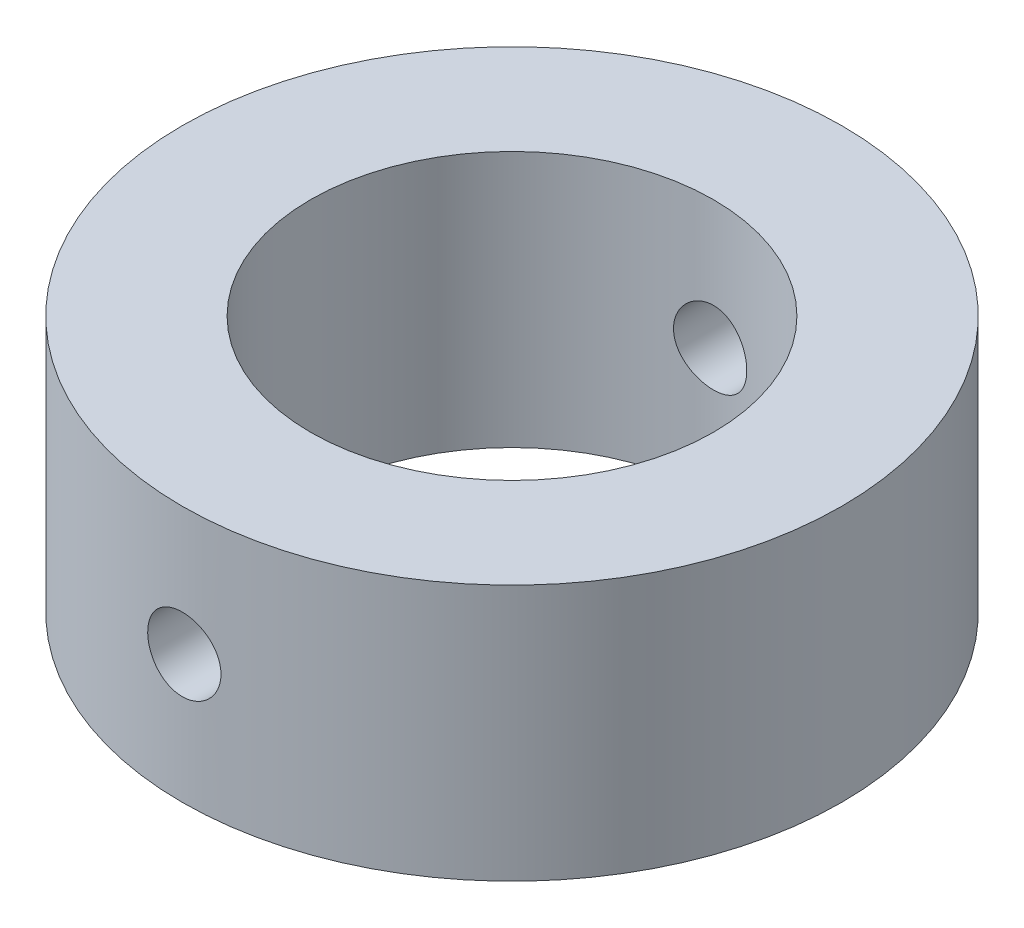
ISO-10303-21;
HEADER;
FILE_DESCRIPTION(('STEP AP214'),'2;1');
FILE_NAME('part.step','',(''),(''),'','','');
FILE_SCHEMA(('AUTOMOTIVE_DESIGN { 1 0 10303 214 1 1 1 1 }'));
ENDSEC;
DATA;
#1=APPLICATION_CONTEXT('core data for automotive mechanical design processes');
#2=APPLICATION_PROTOCOL_DEFINITION('international standard','automotive_design',2000,#1);
#3=PRODUCT_CONTEXT('',#1,'mechanical');
#4=PRODUCT('Part','Part','',(#3));
#5=PRODUCT_RELATED_PRODUCT_CATEGORY('part','',(#4));
#6=PRODUCT_DEFINITION_FORMATION('','',#4);
#7=PRODUCT_DEFINITION_CONTEXT('part definition',#1,'design');
#8=PRODUCT_DEFINITION('design','',#6,#7);
#9=PRODUCT_DEFINITION_SHAPE('','',#8);
#10=(LENGTH_UNIT() NAMED_UNIT(*) SI_UNIT(.MILLI.,.METRE.));
#11=(NAMED_UNIT(*) PLANE_ANGLE_UNIT() SI_UNIT($,.RADIAN.));
#12=(NAMED_UNIT(*) SI_UNIT($,.STERADIAN.) SOLID_ANGLE_UNIT());
#13=UNCERTAINTY_MEASURE_WITH_UNIT(LENGTH_MEASURE(1.E-05),#10,'distance_accuracy_value','');
#14=(GEOMETRIC_REPRESENTATION_CONTEXT(3) GLOBAL_UNCERTAINTY_ASSIGNED_CONTEXT((#13)) GLOBAL_UNIT_ASSIGNED_CONTEXT((#10,
#11,#12)) REPRESENTATION_CONTEXT('',''));
#15=CARTESIAN_POINT('',(0.,0.,0.));
#16=DIRECTION('',(0.,0.,1.));
#17=DIRECTION('',(1.,0.,0.));
#18=AXIS2_PLACEMENT_3D('',#15,#16,#17);
#19=CARTESIAN_POINT('',(0.,7.,0.));
#20=DIRECTION('',(0.,1.,0.));
#21=DIRECTION('',(0.,0.,1.));
#22=AXIS2_PLACEMENT_3D('',#19,#20,#21);
#23=PLANE('',#22);
#24=CARTESIAN_POINT('',(0.,7.,0.));
#25=DIRECTION('',(0.,1.,0.));
#26=DIRECTION('',(0.,0.,1.));
#27=AXIS2_PLACEMENT_3D('',#24,#25,#26);
#28=CIRCLE('',#27,18.);
#29=CARTESIAN_POINT('',(0.,7.,18.));
#30=VERTEX_POINT('',#29);
#31=EDGE_CURVE('E10',#30,#30,#28,.T.);
#32=ORIENTED_EDGE('',*,*,#31,.T.);
#33=EDGE_LOOP('',(#32));
#34=FACE_BOUND('',#33,.T.);
#35=CARTESIAN_POINT('',(0.,7.,0.));
#36=DIRECTION('',(0.,1.,0.));
#37=DIRECTION('',(0.,0.,1.));
#38=AXIS2_PLACEMENT_3D('',#35,#36,#37);
#39=CIRCLE('',#38,11.);
#40=CARTESIAN_POINT('',(0.,7.,11.));
#41=VERTEX_POINT('',#40);
#42=EDGE_CURVE('E60',#41,#41,#39,.T.);
#43=ORIENTED_EDGE('',*,*,#42,.F.);
#44=EDGE_LOOP('',(#43));
#45=FACE_BOUND('',#44,.T.);
#46=ADVANCED_FACE('F41',(#34,#45),#23,.T.);
#47=CARTESIAN_POINT('',(0.,-7.,0.));
#48=DIRECTION('',(0.,1.,0.));
#49=DIRECTION('',(0.,0.,1.));
#50=AXIS2_PLACEMENT_3D('',#47,#48,#49);
#51=PLANE('',#50);
#52=CARTESIAN_POINT('',(0.,-7.,0.));
#53=DIRECTION('',(0.,1.,0.));
#54=DIRECTION('',(0.,0.,1.));
#55=AXIS2_PLACEMENT_3D('',#52,#53,#54);
#56=CIRCLE('',#55,18.);
#57=CARTESIAN_POINT('',(0.,-7.,18.));
#58=VERTEX_POINT('',#57);
#59=EDGE_CURVE('E55',#58,#58,#56,.T.);
#60=ORIENTED_EDGE('',*,*,#59,.F.);
#61=EDGE_LOOP('',(#60));
#62=FACE_BOUND('',#61,.T.);
#63=CARTESIAN_POINT('',(0.,-7.,0.));
#64=DIRECTION('',(0.,1.,0.));
#65=DIRECTION('',(0.,0.,1.));
#66=AXIS2_PLACEMENT_3D('',#63,#64,#65);
#67=CIRCLE('',#66,11.);
#68=CARTESIAN_POINT('',(0.,-7.,11.));
#69=VERTEX_POINT('',#68);
#70=EDGE_CURVE('E63',#69,#69,#67,.T.);
#71=ORIENTED_EDGE('',*,*,#70,.T.);
#72=EDGE_LOOP('',(#71));
#73=FACE_BOUND('',#72,.T.);
#74=ADVANCED_FACE('F99',(#62,#73),#51,.F.);
#75=CARTESIAN_POINT('',(0.,7.,0.));
#76=DIRECTION('',(0.,-1.,0.));
#77=DIRECTION('',(0.,0.,-1.));
#78=AXIS2_PLACEMENT_3D('',#75,#76,#77);
#79=CYLINDRICAL_SURFACE('',#78,18.);
#80=CARTESIAN_POINT('',(0.,2.,-18.));
#81=CARTESIAN_POINT('',(-0.111970632349519,1.99999518717274,-17.9999985855436));
#82=CARTESIAN_POINT('',(-0.22401360296951,1.99056525489512,-17.9989441411048));
#83=CARTESIAN_POINT('',(-0.444988473846702,1.95309247157582,-17.9948391595619));
#84=CARTESIAN_POINT('',(-0.553916889117786,1.92502956094916,-17.9917864712715));
#85=CARTESIAN_POINT('',(-0.765431079070291,1.85112204481784,-17.9840293073923));
#86=CARTESIAN_POINT('',(-0.868020820737628,1.8052886941403,-17.9793258774716));
#87=CARTESIAN_POINT('',(-1.06403053009986,1.69716438580146,-17.9687919810869));
#88=CARTESIAN_POINT('',(-1.1574522117349,1.63487651233084,-17.9629617258869));
#89=CARTESIAN_POINT('',(-1.33290575747026,1.49531794987183,-17.9507977181856));
#90=CARTESIAN_POINT('',(-1.4148915795421,1.41798953514322,-17.9444620831364));
#91=CARTESIAN_POINT('',(-1.56475003710051,1.2506685239635,-17.9320167832537));
#92=CARTESIAN_POINT('',(-1.63262199299226,1.16067531804146,-17.9259071293129));
#93=CARTESIAN_POINT('',(-1.7524930181623,0.970286071769773,-17.9145866794937));
#94=CARTESIAN_POINT('',(-1.80444975542339,0.869863222950149,-17.9093782965755));
#95=CARTESIAN_POINT('',(-1.89074517800796,0.661650539312929,-17.9004741803531));
#96=CARTESIAN_POINT('',(-1.92508439501976,0.553860926931999,-17.8967784014));
#97=CARTESIAN_POINT('',(-1.97503194492644,0.334448002135696,-17.8913354423153));
#98=CARTESIAN_POINT('',(-1.99071729842217,0.222842424929062,-17.8895802517469));
#99=CARTESIAN_POINT('',(-2.00315006003506,-0.00142986183008502,-17.8881925066123));
#100=CARTESIAN_POINT('',(-1.99989807564483,-0.114096537227774,-17.8885598839559));
#101=CARTESIAN_POINT('',(-1.97461184427901,-0.336759474971588,-17.891368441014));
#102=CARTESIAN_POINT('',(-1.95266200172973,-0.446765456674598,-17.8938003012309));
#103=CARTESIAN_POINT('',(-1.89073461157689,-0.661522625388757,-17.9004492717341));
#104=CARTESIAN_POINT('',(-1.85075676930152,-0.766273726476568,-17.904666411201));
#105=CARTESIAN_POINT('',(-1.75381606079451,-0.967812423163108,-17.9144214425039));
#106=CARTESIAN_POINT('',(-1.6968160688148,-1.06458201601582,-17.9199622158801));
#107=CARTESIAN_POINT('',(-1.56747570663675,-1.24721365073087,-17.9317378723191));
#108=CARTESIAN_POINT('',(-1.49513478176794,-1.33307529802335,-17.9379727804753));
#109=CARTESIAN_POINT('',(-1.33669614893956,-1.49194398430861,-17.9504756897929));
#110=CARTESIAN_POINT('',(-1.25052560566827,-1.56487840522475,-17.9567436860931));
#111=CARTESIAN_POINT('',(-1.06712581996098,-1.69525838167234,-17.9685745710182));
#112=CARTESIAN_POINT('',(-0.969896560277035,-1.75270391304576,-17.9741374585434));
#113=CARTESIAN_POINT('',(-0.767086635535504,-1.85047376476476,-17.9839338102592));
#114=CARTESIAN_POINT('',(-0.661504004801704,-1.89079404097506,-17.9881669603705));
#115=CARTESIAN_POINT('',(-0.445009755639361,-1.95311377504167,-17.9948238450129));
#116=CARTESIAN_POINT('',(-0.334098334257908,-1.97511390978633,-17.997247646395));
#117=CARTESIAN_POINT('',(-0.110723331894269,-2.00007590171753,-18.0000041106556));
#118=CARTESIAN_POINT('',(0.00172892889089294,-2.00313789379621,-18.0003477720089));
#119=CARTESIAN_POINT('',(0.225544988687161,-1.99040020748693,-17.998934812043));
#120=CARTESIAN_POINT('',(0.33690880589132,-1.97460084490708,-17.9971782258895));
#121=CARTESIAN_POINT('',(0.555095059423331,-1.92467205954415,-17.9917690933051));
#122=CARTESIAN_POINT('',(0.661928438561836,-1.89058988188252,-17.9881214344582));
#123=CARTESIAN_POINT('',(0.868362270126896,-1.80511172227189,-17.9793390034163));
#124=CARTESIAN_POINT('',(0.967962524792293,-1.75371526714897,-17.9742041905801));
#125=CARTESIAN_POINT('',(1.15755326511746,-1.63482170892903,-17.9629935700227));
#126=CARTESIAN_POINT('',(1.24750253139102,-1.56725923906018,-17.9569139780361));
#127=CARTESIAN_POINT('',(1.41481983480219,-1.41804470166563,-17.9445071585437));
#128=CARTESIAN_POINT('',(1.49218748015557,-1.33639219554766,-17.938179923334));
#129=CARTESIAN_POINT('',(1.63249622432816,-1.16087671093394,-17.925957484036));
#130=CARTESIAN_POINT('',(1.69537132537921,-1.06696080952172,-17.920064336427));
#131=CARTESIAN_POINT('',(1.80445556005008,-0.869843716507564,-17.9094097287311));
#132=CARTESIAN_POINT('',(1.85066496700075,-0.766642677224086,-17.9046482500845));
#133=CARTESIAN_POINT('',(1.92499712101143,-0.554105541283379,-17.8968094822665));
#134=CARTESIAN_POINT('',(1.95315827481128,-0.44478301425242,-17.8937286188355));
#135=CARTESIAN_POINT('',(1.99071877766797,-0.222924852258367,-17.8895891957456));
#136=CARTESIAN_POINT('',(2.00011880320655,-0.11038933329655,-17.8885305631698));
#137=CARTESIAN_POINT('',(1.99987957341679,0.114044155065053,-17.8885572584665));
#138=CARTESIAN_POINT('',(1.99034399043058,0.225942250680951,-17.8896309120887));
#139=CARTESIAN_POINT('',(1.9527225008048,0.446535738325604,-17.8937762295707));
#140=CARTESIAN_POINT('',(1.92463658036714,0.555231127972063,-17.8968478949167));
#141=CARTESIAN_POINT('',(1.85074191262564,0.766327510509217,-17.9046397451111));
#142=CARTESIAN_POINT('',(1.80493703938195,0.868729873635424,-17.9093595695852));
#143=CARTESIAN_POINT('',(1.69691508787252,1.0644104934481,-17.9199166120206));
#144=CARTESIAN_POINT('',(1.63469797623759,1.15768873158296,-17.9257538322538));
#145=CARTESIAN_POINT('',(1.49522995253707,1.33300424612643,-17.9379262794022));
#146=CARTESIAN_POINT('',(1.41790170900318,1.41497983547593,-17.944263963574));
#147=CARTESIAN_POINT('',(1.25056419248413,1.5648338722108,-17.9567010614173));
#148=CARTESIAN_POINT('',(1.16055190760651,1.63270896185917,-17.962800418056));
#149=CARTESIAN_POINT('',(0.970094486774868,1.75260433035013,-17.9740935209669));
#150=CARTESIAN_POINT('',(0.869618446416091,1.80457574973094,-17.9792844558708));
#151=CARTESIAN_POINT('',(0.66136849516123,1.89083749244483,-17.9881463543356));
#152=CARTESIAN_POINT('',(0.55360283994444,1.92514745073418,-17.9918190049356));
#153=CARTESIAN_POINT('',(0.371040239312598,1.96669916146577,-17.9963232552591));
#154=CARTESIAN_POINT('',(0.297404134861362,1.97916954843922,-17.9976954860037));
#155=CARTESIAN_POINT('',(0.149189389902707,1.99582154886399,-17.9995343271896));
#156=CARTESIAN_POINT('',(0.0746107544775069,2.00000320698978,-18.000000942512));
#157=CARTESIAN_POINT('',(0.,2.,-18.));
#158=B_SPLINE_CURVE_WITH_KNOTS('',3,(#80,#81,#82,#83,#84,#85,#86,#87,#88,#89,#90,#91,#92,#93,
#94,#95,#96,#97,#98,#99,#100,#101,#102,#103,#104,#105,#106,#107,#108,#109,#110,#111,#112,#113,
#114,#115,#116,#117,#118,#119,#120,#121,#122,#123,#124,#125,#126,#127,#128,#129,#130,#131,#132,
#133,#134,#135,#136,#137,#138,#139,#140,#141,#142,#143,#144,#145,#146,#147,#148,#149,#150,#151,
#152,#153,#154,#155,#156,#157),.UNSPECIFIED.,.T.,.F.,(4,2,2,2,2,2,2,2,2,2,2,2,2,2,2,2,2,2,2,2,2,
2,2,2,2,2,2,2,2,2,2,2,2,2,2,2,2,2,4),(0.,0.335639414270807,0.671640752838988,1.00742963320074,
1.34315561881719,1.68019649784365,2.01725360192296,2.35519959306228,2.69313538455338,
3.02967096220247,3.36619574415512,3.70120941343134,4.03622855878184,4.37198379333011,
4.70775116959619,5.0453487253329,5.3829468076176,5.72062456954608,6.05828985448105,
6.39416820670407,6.73004093517319,7.06504987759405,7.40006797606269,7.73646430887643,
8.07287111486782,8.41078088557856,8.74868511404414,9.08586787252136,9.42303847276942,
9.75836815539861,10.0936980874527,10.4289547445926,10.7642120833782,11.1012322946639,
11.4383326684529,11.7764585228658,12.1142076528796,12.3378595549845,12.5615102516508),.UNSPECIFIED.);
#159=CARTESIAN_POINT('',(0.,2.,-18.));
#160=VERTEX_POINT('',#159);
#161=EDGE_CURVE('E88',#160,#160,#158,.T.);
#162=ORIENTED_EDGE('',*,*,#161,.T.);
#163=EDGE_LOOP('',(#162));
#164=FACE_BOUND('',#163,.T.);
#165=CARTESIAN_POINT('',(2.,0.,17.8885438199983));
#166=CARTESIAN_POINT('',(1.99999518503575,-0.111968226954188,17.8885452673513));
#167=CARTESIAN_POINT('',(1.99056564422495,-0.22400879952899,17.8896064083062));
#168=CARTESIAN_POINT('',(1.9530945571327,-0.444978688113826,17.8937353069379));
#169=CARTESIAN_POINT('',(1.92503294287933,-0.553904517249662,17.8968052281518));
#170=CARTESIAN_POINT('',(1.85112921882987,-0.765413238050207,17.9045997629771));
#171=CARTESIAN_POINT('',(1.80529842543048,-0.868000118596708,17.9093233232741));
#172=CARTESIAN_POINT('',(1.6971801398522,-1.0640050312931,17.9198916263535));
#173=CARTESIAN_POINT('',(1.63489572561389,-1.15742477384015,17.9257361593821));
#174=CARTESIAN_POINT('',(1.49534066211955,-1.33288049818134,17.9379170304468));
#175=CARTESIAN_POINT('',(1.41801151386004,-1.41486982635829,17.9442552283822));
#176=CARTESIAN_POINT('',(1.25068756201248,-1.56473505390659,17.956692464558));
#177=CARTESIAN_POINT('',(1.16069215853742,-1.6326102844422,17.9627914914535));
#178=CARTESIAN_POINT('',(0.970300975910865,-1.75248474260362,17.9740818874251));
#179=CARTESIAN_POINT('',(0.869878766261949,-1.80444223723359,17.9792708555609));
#180=CARTESIAN_POINT('',(0.661667471517998,-1.89073923619886,17.9881361419533));
#181=CARTESIAN_POINT('',(0.553878605135573,-1.92507926333131,17.9918125050956));
#182=CARTESIAN_POINT('',(0.334468008621896,-1.97502849322176,17.9972252779851));
#183=CARTESIAN_POINT('',(0.222864029559306,-1.99071479178831,17.9989696704928));
#184=CARTESIAN_POINT('',(-0.00140512478551102,-2.00314999730295,18.0003491557537));
#185=CARTESIAN_POINT('',(-0.114070266492344,-1.99989950141874,17.999984315021));
#186=CARTESIAN_POINT('',(-0.336739745879572,-1.97461563521794,17.9971929428148));
#187=CARTESIAN_POINT('',(-0.446753627473802,-1.95266517064822,17.9947755115965));
#188=CARTESIAN_POINT('',(-0.661526274498665,-1.89073380147306,17.9881609397357));
#189=CARTESIAN_POINT('',(-0.766284958137244,-1.85075261633365,17.983963771403));
#190=CARTESIAN_POINT('',(-0.967832879518122,-1.75380496878332,17.9742457977887));
#191=CARTESIAN_POINT('',(-1.06460449111718,-1.69680215768824,17.9687221649126));
#192=CARTESIAN_POINT('',(-1.2472389694308,-1.56745576931318,17.9569703102514));
#193=CARTESIAN_POINT('',(-1.33310144059904,-1.49511163603744,17.9507420629336));
#194=CARTESIAN_POINT('',(-1.49196653465317,-1.33667071691282,17.9382394115377));
#195=CARTESIAN_POINT('',(-1.56489718633274,-1.25050175345599,17.9319649398659));
#196=CARTESIAN_POINT('',(-1.69527030904771,-1.06710647531464,17.9201104242365));
#197=CARTESIAN_POINT('',(-1.75271274805118,-0.969880137762416,17.9145303817151));
#198=CARTESIAN_POINT('',(-1.85048037105374,-0.767071026530246,17.9046962899179));
#199=CARTESIAN_POINT('',(-1.89080055980943,-0.661485824880405,17.9004426276963));
#200=CARTESIAN_POINT('',(-1.95311933213687,-0.444985984242083,17.8937507545429));
#201=CARTESIAN_POINT('',(-1.97511860833,-0.334071546892834,17.891312474981));
#202=CARTESIAN_POINT('',(-2.00007735935568,-0.11069510696495,17.8885396347188));
#203=CARTESIAN_POINT('',(-2.00313777083876,0.00175548459326164,17.8881939216838));
#204=CARTESIAN_POINT('',(-1.99039751910215,0.225567827031347,17.8896159038576));
#205=CARTESIAN_POINT('',(-1.97459717180621,0.336929596117845,17.8913835636668));
#206=CARTESIAN_POINT('',(-1.92466859187558,0.555105485339679,17.8968229651343));
#207=CARTESIAN_POINT('',(-1.89058856475884,0.661930772675792,17.9004896978583));
#208=CARTESIAN_POINT('',(-1.80511741398991,0.868349371183926,17.9093100409564));
#209=CARTESIAN_POINT('',(-1.75372580444061,0.967942479269591,17.9144636930643));
#210=CARTESIAN_POINT('',(-1.63483941033055,1.1575282931936,17.9257040762847));
#211=CARTESIAN_POINT('',(-1.56727802875607,1.24747900693807,17.9317946280501));
#212=CARTESIAN_POINT('',(-1.41806481392953,1.41479973723392,17.9442102793975));
#213=CARTESIAN_POINT('',(-1.33641254922635,1.49216936842207,17.9505353861566));
#214=CARTESIAN_POINT('',(-1.16089620972329,1.63248248532022,17.9627413925405));
#215=CARTESIAN_POINT('',(-1.06697916673199,1.69535992327816,17.968620179616));
#216=CARTESIAN_POINT('',(-0.869859159636977,1.80444825682681,17.9792400807963));
#217=CARTESIAN_POINT('',(-0.766656348352902,1.85065942663837,17.9839812136192));
#218=CARTESIAN_POINT('',(-0.554120264945933,1.92499272889714,17.9917821449637));
#219=CARTESIAN_POINT('',(-0.444800831566823,1.95315403200578,17.9948455821934));
#220=CARTESIAN_POINT('',(-0.222949200757917,1.99071588146752,17.9989609669259));
#221=CARTESIAN_POINT('',(-0.110417116473332,2.00011708770109,18.0000129851797));
#222=CARTESIAN_POINT('',(0.114018334496894,1.99988133626741,17.9999868395735));
#223=CARTESIAN_POINT('',(0.225921823844598,1.99034661842582,17.9989201153349));
#224=CARTESIAN_POINT('',(0.446526316926466,1.95272496321899,17.9947989686735));
#225=CARTESIAN_POINT('',(0.555227319914946,1.92463802153398,17.9917445457879));
#226=CARTESIAN_POINT('',(0.766335076615752,1.85073915596262,17.9839899544047));
#227=CARTESIAN_POINT('',(0.86874317607688,1.8049310371763,17.9792901392271));
#228=CARTESIAN_POINT('',(1.06443391664963,1.69690081603447,17.9687671981842));
#229=CARTESIAN_POINT('',(1.15771654277213,1.63467868671863,17.9629440704738));
#230=CARTESIAN_POINT('',(1.33303189850074,1.49520510358297,17.9507882968297));
#231=CARTESIAN_POINT('',(1.41500385164123,1.41787746860296,17.9444531678765));
#232=CARTESIAN_POINT('',(1.56485083590747,1.2505426709214,17.9320080016661));
#233=CARTESIAN_POINT('',(1.63272249971267,1.16053248806638,17.9258980184622));
#234=CARTESIAN_POINT('',(1.75261413385152,0.970076820326278,17.9145748576723));
#235=CARTESIAN_POINT('',(1.80458464165387,0.869600051342168,17.9093644999484));
#236=CARTESIAN_POINT('',(1.89084447897051,0.66134856315658,17.9004638112766));
#237=CARTESIAN_POINT('',(1.92515345522498,0.553582104730511,17.8967717922482));
#238=CARTESIAN_POINT('',(1.96670243154842,0.371022125055509,17.8922425310128));
#239=CARTESIAN_POINT('',(1.97917158766845,0.297389637680329,17.8908622174332));
#240=CARTESIAN_POINT('',(1.99582195322212,0.149182136930696,17.8890123822324));
#241=CARTESIAN_POINT('',(2.00000320832675,0.0746071287523425,17.8885428555921));
#242=CARTESIAN_POINT('',(2.,0.,17.8885438199983));
#243=B_SPLINE_CURVE_WITH_KNOTS('',3,(#165,#166,#167,#168,#169,#170,#171,#172,#173,#174,#175,
#176,#177,#178,#179,#180,#181,#182,#183,#184,#185,#186,#187,#188,#189,#190,#191,#192,#193,#194,
#195,#196,#197,#198,#199,#200,#201,#202,#203,#204,#205,#206,#207,#208,#209,#210,#211,#212,#213,
#214,#215,#216,#217,#218,#219,#220,#221,#222,#223,#224,#225,#226,#227,#228,#229,#230,#231,#232,
#233,#234,#235,#236,#237,#238,#239,#240,#241,#242),.UNSPECIFIED.,.T.,.F.,(4,2,2,2,2,2,2,2,2,2,2,
2,2,2,2,2,2,2,2,2,2,2,2,2,2,2,2,2,2,2,2,2,2,2,2,2,2,2,4),(0.,0.335632188624974,
0.671626462934656,1.00740710805003,1.34312498388733,1.68017531935543,2.01724162325253,
2.35518422792107,2.69311680358594,3.02964779613957,3.36616817631889,3.70120432175367,
4.03624568008393,4.37200767925155,4.70778184908852,5.04536979065502,5.3829584303983,
5.7206454906652,6.0583197841067,6.39419284630556,6.73006028260191,7.06504632328859,
7.40004176706191,7.73644141772486,8.07285137049336,8.41076545330537,8.74867397594563,
9.08584668590625,9.42300753571449,9.7583529180042,10.0936983783768,10.4289718731341,
10.7642459185884,11.1012566562892,11.4383477839705,11.7764770582129,12.1142293791938,
12.3378704296957,12.5615102478061),.UNSPECIFIED.);
#244=CARTESIAN_POINT('',(2.,0.,17.8885438199983));
#245=VERTEX_POINT('',#244);
#246=EDGE_CURVE('E83',#245,#245,#243,.T.);
#247=ORIENTED_EDGE('',*,*,#246,.T.);
#248=EDGE_LOOP('',(#247));
#249=FACE_BOUND('',#248,.T.);
#250=ORIENTED_EDGE('',*,*,#31,.F.);
#251=EDGE_LOOP('',(#250));
#252=FACE_BOUND('',#251,.T.);
#253=ORIENTED_EDGE('',*,*,#59,.T.);
#254=EDGE_LOOP('',(#253));
#255=FACE_BOUND('',#254,.T.);
#256=ADVANCED_FACE('F43',(#164,#249,#252,#255),#79,.T.);
#257=CARTESIAN_POINT('',(0.,7.,0.));
#258=DIRECTION('',(0.,-1.,0.));
#259=DIRECTION('',(0.,0.,-1.));
#260=AXIS2_PLACEMENT_3D('',#257,#258,#259);
#261=CYLINDRICAL_SURFACE('',#260,11.);
#262=CARTESIAN_POINT('',(0.,2.,-11.));
#263=CARTESIAN_POINT('',(-0.111357271644373,1.99999568133932,-10.9999980072786));
#264=CARTESIAN_POINT('',(-0.222771449918202,1.99066824251735,-10.9982915273343));
#265=CARTESIAN_POINT('',(-0.442464406848309,1.95362653397508,-10.99164847502));
#266=CARTESIAN_POINT('',(-0.550740387266074,1.92589635141863,-10.9867091072254));
#267=CARTESIAN_POINT('',(-0.760947572513747,1.85292287032901,-10.9741532323507));
#268=CARTESIAN_POINT('',(-0.862884263930176,1.80769496781024,-10.9665390793192));
#269=CARTESIAN_POINT('',(-1.0577120033845,1.70105266880821,-10.949466714983));
#270=CARTESIAN_POINT('',(-1.15060386767904,1.63963973481181,-10.9400086703132));
#271=CARTESIAN_POINT('',(-1.32576444051238,1.50163409035729,-10.9201743349983));
#272=CARTESIAN_POINT('',(-1.40791622603346,1.42489415801924,-10.9097897259708));
#273=CARTESIAN_POINT('',(-1.55825357341079,1.25872964591017,-10.8893349521181));
#274=CARTESIAN_POINT('',(-1.62643816794977,1.16930418831085,-10.8792648091126));
#275=CARTESIAN_POINT('',(-1.74738695016477,0.979487270540227,-10.8604984020977));
#276=CARTESIAN_POINT('',(-1.80003313265556,0.879019464769625,-10.851812871101));
#277=CARTESIAN_POINT('',(-1.88765546949978,0.670481349676033,-10.836915832769));
#278=CARTESIAN_POINT('',(-1.92263305283275,0.562411655974962,-10.8307041253674));
#279=CARTESIAN_POINT('',(-1.97355197711315,0.342985350643402,-10.8215415351671));
#280=CARTESIAN_POINT('',(-1.98969666425445,0.231677408290375,-10.8185558462234));
#281=CARTESIAN_POINT('',(-2.00312248736688,0.0078955926854322,-10.8160783143231));
#282=CARTESIAN_POINT('',(-2.00040521296643,-0.104578181516031,-10.8165861769405));
#283=CARTESIAN_POINT('',(-1.97634934427,-0.326031914133018,-10.8210066504918));
#284=CARTESIAN_POINT('',(-1.95524117699072,-0.435037867895722,-10.8248771281426));
#285=CARTESIAN_POINT('',(-1.89536523340026,-0.647935018367165,-10.8355206127391));
#286=CARTESIAN_POINT('',(-1.85659674743188,-0.75182600935179,-10.8422937363232));
#287=CARTESIAN_POINT('',(-1.76227297789295,-0.952222790778736,-10.8580238155272));
#288=CARTESIAN_POINT('',(-1.7066239037154,-1.04868344266613,-10.8669929171435));
#289=CARTESIAN_POINT('',(-1.58018503374043,-1.23098473694529,-10.8860962201172));
#290=CARTESIAN_POINT('',(-1.50939379023584,-1.31682436264624,-10.8962305328347));
#291=CARTESIAN_POINT('',(-1.35343399418352,-1.47677899644437,-10.9167064080854));
#292=CARTESIAN_POINT('',(-1.2680681726569,-1.55070168843691,-10.9270488181647));
#293=CARTESIAN_POINT('',(-1.08604454069331,-1.68320513348083,-10.9466375043709));
#294=CARTESIAN_POINT('',(-0.989386629498157,-1.74178574962126,-10.9558837707156));
#295=CARTESIAN_POINT('',(-0.787327598497296,-1.84196738978503,-10.9722553782534));
#296=CARTESIAN_POINT('',(-0.681916780395492,-1.88354926869598,-10.9793783255922));
#297=CARTESIAN_POINT('',(-0.465448414462666,-1.9483631924937,-10.9906820547088));
#298=CARTESIAN_POINT('',(-0.354391431316065,-1.97159706857391,-10.994863130091));
#299=CARTESIAN_POINT('',(-0.131438649578499,-1.99878976191912,-10.9997719337866));
#300=CARTESIAN_POINT('',(-0.0195760121089339,-2.00301222345408,-11.0005468934114));
#301=CARTESIAN_POINT('',(0.203257238970967,-1.99276820181851,-10.998686302475));
#302=CARTESIAN_POINT('',(0.314227893453082,-1.97830257992826,-10.9960509090871));
#303=CARTESIAN_POINT('',(0.531297097592757,-1.93131225043812,-10.9876950863245));
#304=CARTESIAN_POINT('',(0.637425297458317,-1.89892013081717,-10.9819973157216));
#305=CARTESIAN_POINT('',(0.84274471375661,-1.81713917147806,-10.9681529512222));
#306=CARTESIAN_POINT('',(0.941935480960949,-1.7677492323023,-10.9600061989244));
#307=CARTESIAN_POINT('',(1.13169524707493,-1.65278536219707,-10.9420497958484));
#308=CARTESIAN_POINT('',(1.22216445208488,-1.58704931284408,-10.932223816146));
#309=CARTESIAN_POINT('',(1.39088213822347,-1.4414796233289,-10.9120428807109));
#310=CARTESIAN_POINT('',(1.46912954974332,-1.36164475058806,-10.901687878785));
#311=CARTESIAN_POINT('',(1.6121773788768,-1.1889531185515,-10.8814603955764));
#312=CARTESIAN_POINT('',(1.67679836741418,-1.09594669347414,-10.8715955212189));
#313=CARTESIAN_POINT('',(1.78949986552014,-0.900243818593513,-10.8536151008102));
#314=CARTESIAN_POINT('',(1.83758096630795,-0.797547715315616,-10.8454994922354));
#315=CARTESIAN_POINT('',(1.91557945241746,-0.585849250308254,-10.8319954461548));
#316=CARTESIAN_POINT('',(1.9455810786184,-0.476878769261946,-10.8265943801675));
#317=CARTESIAN_POINT('',(1.98683040178554,-0.255337011368931,-10.8191012654539));
#318=CARTESIAN_POINT('',(1.99808007453629,-0.142766115151078,-10.8170088681136));
#319=CARTESIAN_POINT('',(2.00144313663184,0.0809853754636368,-10.8163869388262));
#320=CARTESIAN_POINT('',(1.99383937001232,0.192161671438542,-10.8178047454411));
#321=CARTESIAN_POINT('',(1.96032846912815,0.411623638017415,-10.8239270874703));
#322=CARTESIAN_POINT('',(1.93442142905718,0.519909323494285,-10.8286316059701));
#323=CARTESIAN_POINT('',(1.86515567158476,0.73037619739537,-10.8407757208091));
#324=CARTESIAN_POINT('',(1.82182581019232,0.832567160223432,-10.8482107929975));
#325=CARTESIAN_POINT('',(1.71897473664823,1.02827444716474,-10.8649817751485));
#326=CARTESIAN_POINT('',(1.65945247569007,1.12179020884559,-10.8743178082294));
#327=CARTESIAN_POINT('',(1.52491543662799,1.29891287459562,-10.8940032465147));
#328=CARTESIAN_POINT('',(1.44969415553099,1.38236156987076,-10.9043650783111));
#329=CARTESIAN_POINT('',(1.28632651423364,1.53554708101219,-10.9248399206865));
#330=CARTESIAN_POINT('',(1.19817718680093,1.60528074039225,-10.9349528735191));
#331=CARTESIAN_POINT('',(1.0105711896463,1.72960029712349,-10.9538897429719));
#332=CARTESIAN_POINT('',(0.911025849790496,1.78405418518013,-10.9627021317343));
#333=CARTESIAN_POINT('',(0.704073905086344,1.87537921607405,-10.9779326099335));
#334=CARTESIAN_POINT('',(0.59667492548667,1.91226715927832,-10.9843529858473));
#335=CARTESIAN_POINT('',(0.407441749458405,1.95977543030219,-10.9927407037649));
#336=CARTESIAN_POINT('',(0.326725427276489,1.97483433296035,-10.9954478027358));
#337=CARTESIAN_POINT('',(0.164016342132202,1.9949480937949,-10.9990781643304));
#338=CARTESIAN_POINT('',(0.0820236084408326,2.00000318104177,-11.0000014678));
#339=CARTESIAN_POINT('',(0.,2.,-11.));
#340=B_SPLINE_CURVE_WITH_KNOTS('',3,(#262,#263,#264,#265,#266,#267,#268,#269,#270,#271,#272,
#273,#274,#275,#276,#277,#278,#279,#280,#281,#282,#283,#284,#285,#286,#287,#288,#289,#290,#291,
#292,#293,#294,#295,#296,#297,#298,#299,#300,#301,#302,#303,#304,#305,#306,#307,#308,#309,#310,
#311,#312,#313,#314,#315,#316,#317,#318,#319,#320,#321,#322,#323,#324,#325,#326,#327,#328,#329,
#330,#331,#332,#333,#334,#335,#336,#337,#338,#339),.UNSPECIFIED.,.T.,.F.,(4,2,2,2,2,2,2,2,2,2,2,
2,2,2,2,2,2,2,2,2,2,2,2,2,2,2,2,2,2,2,2,2,2,2,2,2,2,2,4),(0.,0.333771891552332,0.66783277207259,
1.00160038286674,1.3353378446015,1.67245014596885,2.00958578663078,2.3492195220365,
2.6888257845573,3.02473021172645,3.36060633024202,3.69233367290895,4.02407434678871,
4.35769306461625,4.69134369321255,5.02993210441872,5.36852353704646,5.70749527023812,
6.04643316861453,6.38065600997364,6.71486344850797,7.0466314328543,7.3784208807422,
7.71364226795666,8.04889297616123,8.38831506130458,8.72772501252474,9.06554101076157,
9.40332141303601,9.73606509730371,10.0688070691931,10.4010002025896,10.733214857769,
11.0701111453004,11.4070848782946,11.7468860454293,12.0863615649817,12.3322171022956,
12.5780670098676),.UNSPECIFIED.);
#341=CARTESIAN_POINT('',(0.,2.,-11.));
#342=VERTEX_POINT('',#341);
#343=EDGE_CURVE('E46',#342,#342,#340,.T.);
#344=ORIENTED_EDGE('',*,*,#343,.F.);
#345=EDGE_LOOP('',(#344));
#346=FACE_BOUND('',#345,.T.);
#347=CARTESIAN_POINT('',(2.,0.,10.816653826392));
#348=CARTESIAN_POINT('',(1.99999566748834,-0.11134012257296,10.8166559469823));
#349=CARTESIAN_POINT('',(1.9906710042305,-0.222737191288005,10.818391586416));
#350=CARTESIAN_POINT('',(1.953641319662,-0.442394615872969,10.825138630904));
#351=CARTESIAN_POINT('',(1.92592032102069,-0.550652159669283,10.8301528833982));
#352=CARTESIAN_POINT('',(1.85297369289719,-0.760820313018511,10.8428709030557));
#353=CARTESIAN_POINT('',(1.80776389192774,-0.862736565308052,10.8505722376174));
#354=CARTESIAN_POINT('',(1.70116425408316,-1.05752989162896,10.8677937983012));
#355=CARTESIAN_POINT('',(1.6397758372698,-1.15040775801638,10.8773138647657));
#356=CARTESIAN_POINT('',(1.50179524823966,-1.32558344744176,10.8972247379328));
#357=CARTESIAN_POINT('',(1.4250503534781,-1.40776007423395,10.9076236306456));
#358=CARTESIAN_POINT('',(1.25886539634161,-1.55814556283443,10.9280489317643));
#359=CARTESIAN_POINT('',(1.1694245247635,-1.62635353364538,10.9380753163763));
#360=CARTESIAN_POINT('',(0.979593418999866,-1.74732731845024,10.9567122399244));
#361=CARTESIAN_POINT('',(0.879129490479886,-1.7999792699958,10.965312146403));
#362=CARTESIAN_POINT('',(0.670599774437609,-1.88761333302614,10.9800367733651));
#363=CARTESIAN_POINT('',(0.562534575326679,-1.92259681050937,10.98616168519));
#364=CARTESIAN_POINT('',(0.343124837820858,-1.97352723325545,10.9951891058833));
#365=CARTESIAN_POINT('',(0.231829128518768,-1.98967831432072,10.9981261454525));
#366=CARTESIAN_POINT('',(0.00807147296592509,-2.0031211674624,11.0005658088946));
#367=CARTESIAN_POINT('',(-0.104390378935038,-2.00041445357154,11.0000687084839));
#368=CARTESIAN_POINT('',(-0.32588919614074,-1.97637585792208,10.9957231855211));
#369=CARTESIAN_POINT('',(-0.434950900053349,-1.95526374648556,10.9919143087691));
#370=CARTESIAN_POINT('',(-0.647957490603365,-1.8953608025385,10.9814174690798));
#371=CARTESIAN_POINT('',(-0.751902198979603,-1.85656935461377,10.974729405919));
#372=CARTESIAN_POINT('',(-0.952366225453847,-1.76219694022084,10.9591592037236));
#373=CARTESIAN_POINT('',(-1.04884289251747,-1.70652735596616,10.9502655302338));
#374=CARTESIAN_POINT('',(-1.23116763357293,-1.58004411007531,10.9312689682172));
#375=CARTESIAN_POINT('',(-1.31701468769822,-1.50922899706451,10.9211659638428));
#376=CARTESIAN_POINT('',(-1.47694445054394,-1.35325154542072,10.9006990809284));
#377=CARTESIAN_POINT('',(-1.55083959404949,-1.26789698208101,10.8903335415211));
#378=CARTESIAN_POINT('',(-1.68329271964166,-1.08590593607908,10.8706496206858));
#379=CARTESIAN_POINT('',(-1.74185050296967,-0.989269307234742,10.861331252829));
#380=CARTESIAN_POINT('',(-1.84201538249093,-0.787217489513175,10.8447947340983));
#381=CARTESIAN_POINT('',(-1.88359655385222,-0.681789168360212,10.8375798001274));
#382=CARTESIAN_POINT('',(-1.94840376886998,-0.465282550111631,10.8261173347694));
#383=CARTESIAN_POINT('',(-1.97163175896676,-0.354204853488856,10.8218694887144));
#384=CARTESIAN_POINT('',(-1.99880217851546,-0.13124019879459,10.8168840409274));
#385=CARTESIAN_POINT('',(-2.00301348489165,-0.0193870673303634,10.8160975038278));
#386=CARTESIAN_POINT('',(-1.9927505477885,0.203424550561076,10.8179929515389));
#387=CARTESIAN_POINT('',(-1.97827717035788,0.314383078213963,10.8206747755886));
#388=CARTESIAN_POINT('',(-1.93128609638897,0.531380344052283,10.8291592937867));
#389=CARTESIAN_POINT('',(-1.89890818855376,0.637450384008028,10.8349378000789));
#390=CARTESIAN_POINT('',(-1.81717497571878,0.842659718828443,10.8489439080076));
#391=CARTESIAN_POINT('',(-1.76781848506108,0.941798529085677,10.8571716806773));
#392=CARTESIAN_POINT('',(-1.65290586187994,1.13151919601525,10.8752613415266));
#393=CARTESIAN_POINT('',(-1.58717917941567,1.22199611808438,10.8851400484298));
#394=CARTESIAN_POINT('',(-1.44162304950736,1.39073369159775,10.9053706629202));
#395=CARTESIAN_POINT('',(-1.36179241301324,1.46899331199966,10.91572261035));
#396=CARTESIAN_POINT('',(-1.18909630007261,1.61207284614979,10.9358898604531));
#397=CARTESIAN_POINT('',(-1.09608023252376,1.6767123553618,10.9456968282676));
#398=CARTESIAN_POINT('',(-0.900352619793527,1.789446306083,10.9635308137777));
#399=CARTESIAN_POINT('',(-0.797641432067847,1.83754135727717,10.9715578970606));
#400=CARTESIAN_POINT('',(-0.585948218345343,1.91554803863644,10.9848917263157));
#401=CARTESIAN_POINT('',(-0.477000329353951,1.94554990487653,10.9902119510479));
#402=CARTESIAN_POINT('',(-0.25550664896348,1.98680734329716,10.9975899747809));
#403=CARTESIAN_POINT('',(-0.14296121367923,1.99806476513671,10.9996480956777));
#404=CARTESIAN_POINT('',(0.0807996190288177,2.00145252110552,11.0002641421388));
#405=CARTESIAN_POINT('',(0.192010837925448,1.99385588848469,10.9988720323112));
#406=CARTESIAN_POINT('',(0.411544538990867,1.96034705357606,10.9928473390214));
#407=CARTESIAN_POINT('',(0.519867045363828,1.93443500480099,10.9882147827193));
#408=CARTESIAN_POINT('',(0.730415433440433,1.86514309651073,10.9762290690773));
#409=CARTESIAN_POINT('',(0.832650596646201,1.82179065462444,10.96888018348));
#410=CARTESIAN_POINT('',(1.02843701194217,1.71888059719124,10.9522592239203));
#411=CARTESIAN_POINT('',(1.12198772879735,1.65932198372258,10.9429870315355));
#412=CARTESIAN_POINT('',(1.29911459753549,1.52474236143811,10.9233859020729));
#413=CARTESIAN_POINT('',(1.38253889858449,1.44952330461567,10.9130443794735));
#414=CARTESIAN_POINT('',(1.53567622355086,1.28617048330647,10.8925517029222));
#415=CARTESIAN_POINT('',(1.60538602436339,1.19803369143839,10.8824005942262));
#416=CARTESIAN_POINT('',(1.72967671803608,1.01044032439889,10.8633428283932));
#417=CARTESIAN_POINT('',(1.78412208501856,0.910892760688651,10.8544476470463));
#418=CARTESIAN_POINT('',(1.87543058906983,0.703936723274017,10.8390461745677));
#419=CARTESIAN_POINT('',(1.9123105996278,0.596535908392186,10.8325375922296));
#420=CARTESIAN_POINT('',(1.95979896205519,0.407323315567744,10.8240281075057));
#421=CARTESIAN_POINT('',(1.97484899189766,0.326630737391384,10.821278872104));
#422=CARTESIAN_POINT('',(1.99495098425024,0.163969047967817,10.8175909727573));
#423=CARTESIAN_POINT('',(2.00000319081575,0.0819999679303415,10.8166522646159));
#424=CARTESIAN_POINT('',(2.,0.,10.816653826392));
#425=B_SPLINE_CURVE_WITH_KNOTS('',3,(#347,#348,#349,#350,#351,#352,#353,#354,#355,#356,#357,
#358,#359,#360,#361,#362,#363,#364,#365,#366,#367,#368,#369,#370,#371,#372,#373,#374,#375,#376,
#377,#378,#379,#380,#381,#382,#383,#384,#385,#386,#387,#388,#389,#390,#391,#392,#393,#394,#395,
#396,#397,#398,#399,#400,#401,#402,#403,#404,#405,#406,#407,#408,#409,#410,#411,#412,#413,#414,
#415,#416,#417,#418,#419,#420,#421,#422,#423,#424),.UNSPECIFIED.,.T.,.F.,(4,2,2,2,2,2,2,2,2,2,2,
2,2,2,2,2,2,2,2,2,2,2,2,2,2,2,2,2,2,2,2,2,2,2,2,2,2,2,4),(0.,0.333720352628771,
0.667730923425361,1.00143989738151,1.33511959011685,1.6722993511526,2.00950061266478,
2.34911212511978,2.6886973772514,3.02456639415963,3.3604084455173,3.69229445292967,
4.02419201411038,4.3578632848798,4.69156654523441,5.03008350848145,5.36860485839155,
5.70764124486732,6.04664167012788,6.38083364646979,6.71501013332593,7.04661365662176,
7.37824034134339,7.71347820234125,8.04874433945132,8.38820522569594,8.72765360102077,
9.06539473675368,9.40310254298626,9.73594847886932,10.0687916249998,10.4011135484041,
10.7334559397116,11.0702887970716,11.4072007206838,11.7470154829573,12.0865031534681,
12.3322881015162,12.5780670496697),.UNSPECIFIED.);
#426=CARTESIAN_POINT('',(2.,0.,10.816653826392));
#427=VERTEX_POINT('',#426);
#428=EDGE_CURVE('E65',#427,#427,#425,.T.);
#429=ORIENTED_EDGE('',*,*,#428,.F.);
#430=EDGE_LOOP('',(#429));
#431=FACE_BOUND('',#430,.T.);
#432=ORIENTED_EDGE('',*,*,#42,.T.);
#433=EDGE_LOOP('',(#432));
#434=FACE_BOUND('',#433,.T.);
#435=ORIENTED_EDGE('',*,*,#70,.F.);
#436=EDGE_LOOP('',(#435));
#437=FACE_BOUND('',#436,.T.);
#438=ADVANCED_FACE('F70',(#346,#431,#434,#437),#261,.F.);
#439=CARTESIAN_POINT('',(0.,0.,-18.));
#440=DIRECTION('',(0.,0.,1.));
#441=DIRECTION('',(1.,0.,0.));
#442=AXIS2_PLACEMENT_3D('',#439,#440,#441);
#443=CYLINDRICAL_SURFACE('',#442,2.);
#444=ORIENTED_EDGE('',*,*,#428,.T.);
#445=EDGE_LOOP('',(#444));
#446=FACE_BOUND('',#445,.T.);
#447=ORIENTED_EDGE('',*,*,#246,.F.);
#448=EDGE_LOOP('',(#447));
#449=FACE_BOUND('',#448,.T.);
#450=ADVANCED_FACE('F76',(#446,#449),#443,.F.);
#451=ORIENTED_EDGE('',*,*,#343,.T.);
#452=EDGE_LOOP('',(#451));
#453=FACE_BOUND('',#452,.T.);
#454=ORIENTED_EDGE('',*,*,#161,.F.);
#455=EDGE_LOOP('',(#454));
#456=FACE_BOUND('',#455,.T.);
#457=ADVANCED_FACE('F73',(#453,#456),#443,.F.);
#458=CLOSED_SHELL('',(#46,#74,#256,#438,#450,#457));
#459=MANIFOLD_SOLID_BREP('B2',#458);
#460=ADVANCED_BREP_SHAPE_REPRESENTATION('',(#18,#459),#14);
#461=SHAPE_DEFINITION_REPRESENTATION(#9,#460);
ENDSEC;
END-ISO-10303-21;
